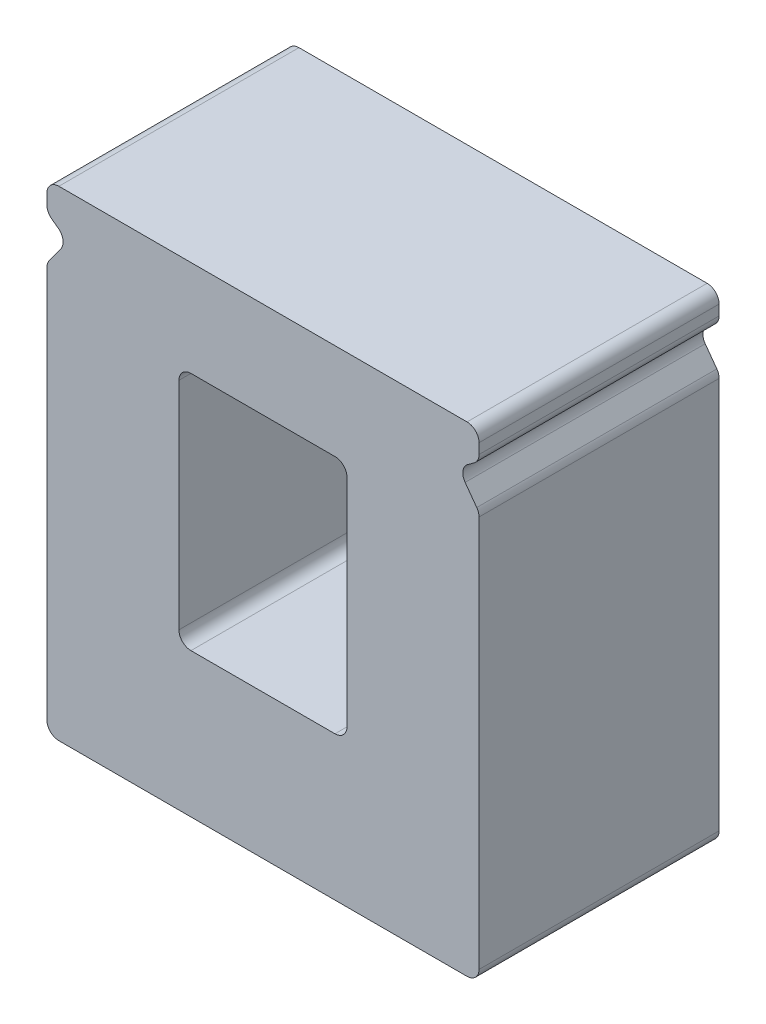
ISO-10303-21;
HEADER;
FILE_DESCRIPTION(('STEP AP214'),'2;1');
FILE_NAME('part.step','',(''),(''),'','','');
FILE_SCHEMA(('AUTOMOTIVE_DESIGN { 1 0 10303 214 1 1 1 1 }'));
ENDSEC;
DATA;
#1=APPLICATION_CONTEXT('core data for automotive mechanical design processes');
#2=APPLICATION_PROTOCOL_DEFINITION('international standard','automotive_design',2000,#1);
#3=PRODUCT_CONTEXT('',#1,'mechanical');
#4=PRODUCT('Part','Part','',(#3));
#5=PRODUCT_RELATED_PRODUCT_CATEGORY('part','',(#4));
#6=PRODUCT_DEFINITION_FORMATION('','',#4);
#7=PRODUCT_DEFINITION_CONTEXT('part definition',#1,'design');
#8=PRODUCT_DEFINITION('design','',#6,#7);
#9=PRODUCT_DEFINITION_SHAPE('','',#8);
#10=(LENGTH_UNIT() NAMED_UNIT(*) SI_UNIT(.MILLI.,.METRE.));
#11=(NAMED_UNIT(*) PLANE_ANGLE_UNIT() SI_UNIT($,.RADIAN.));
#12=(NAMED_UNIT(*) SI_UNIT($,.STERADIAN.) SOLID_ANGLE_UNIT());
#13=UNCERTAINTY_MEASURE_WITH_UNIT(LENGTH_MEASURE(1.E-05),#10,'distance_accuracy_value','');
#14=(GEOMETRIC_REPRESENTATION_CONTEXT(3) GLOBAL_UNCERTAINTY_ASSIGNED_CONTEXT((#13)) GLOBAL_UNIT_ASSIGNED_CONTEXT((#10,
#11,#12)) REPRESENTATION_CONTEXT('',''));
#15=CARTESIAN_POINT('',(0.,0.,0.));
#16=DIRECTION('',(0.,0.,1.));
#17=DIRECTION('',(1.,0.,0.));
#18=AXIS2_PLACEMENT_3D('',#15,#16,#17);
#19=CARTESIAN_POINT('',(-0.943975104065,-0.989782461654,0.));
#20=DIRECTION('',(0.,0.,1.));
#21=DIRECTION('',(1.,0.,0.));
#22=AXIS2_PLACEMENT_3D('',#19,#20,#21);
#23=PLANE('',#22);
#24=DIRECTION('',(1.,0.,0.));
#25=VECTOR('',#24,1.);
#26=CARTESIAN_POINT('',(0.856024895935,1.010217538346,0.));
#27=LINE('',#26,#25);
#28=CARTESIAN_POINT('',(-0.893975104065,1.010217538346,0.));
#29=VERTEX_POINT('',#28);
#30=CARTESIAN_POINT('',(0.806024895935,1.010217538346,0.));
#31=VERTEX_POINT('',#30);
#32=EDGE_CURVE('E268',#29,#31,#27,.T.);
#33=ORIENTED_EDGE('',*,*,#32,.T.);
#34=CARTESIAN_POINT('',(0.806024895935,0.960217538346,0.));
#35=DIRECTION('',(0.,0.,-1.));
#36=DIRECTION('',(-1.,0.,0.));
#37=AXIS2_PLACEMENT_3D('',#34,#35,#36);
#38=CIRCLE('',#37,0.05);
#39=CARTESIAN_POINT('',(0.856024895935,0.960217538346,0.));
#40=VERTEX_POINT('',#39);
#41=EDGE_CURVE('E272',#40,#31,#38,.F.);
#42=ORIENTED_EDGE('',*,*,#41,.F.);
#43=DIRECTION('',(0.,1.,0.));
#44=VECTOR('',#43,1.);
#45=CARTESIAN_POINT('',(0.856024895935,1.010217538346,0.));
#46=LINE('',#45,#44);
#47=CARTESIAN_POINT('',(0.856024895935,0.917544080107,0.));
#48=VERTEX_POINT('',#47);
#49=EDGE_CURVE('E275',#40,#48,#46,.F.);
#50=ORIENTED_EDGE('',*,*,#49,.T.);
#51=CARTESIAN_POINT('',(0.806024895935,0.917544080107,0.));
#52=DIRECTION('',(0.,0.,-1.));
#53=DIRECTION('',(-1.,0.,0.));
#54=AXIS2_PLACEMENT_3D('',#51,#52,#53);
#55=CIRCLE('',#54,0.05);
#56=CARTESIAN_POINT('',(0.835433480818422,0.877107275891953,0.));
#57=VERTEX_POINT('',#56);
#58=EDGE_CURVE('E305',#57,#48,#55,.F.);
#59=ORIENTED_EDGE('',*,*,#58,.F.);
#60=DIRECTION('',(0.808736084301861,0.588171697676871,0.));
#61=VECTOR('',#60,1.);
#62=CARTESIAN_POINT('',(0.809106947361,0.857960706105,0.));
#63=LINE('',#62,#61);
#64=CARTESIAN_POINT('',(0.809106947361182,0.857960706104903,0.));
#65=VERTEX_POINT('',#64);
#66=EDGE_CURVE('E303',#65,#57,#63,.T.);
#67=ORIENTED_EDGE('',*,*,#66,.F.);
#68=CARTESIAN_POINT('',(0.838515532245,0.81752390189,0.));
#69=DIRECTION('',(0.,0.,1.));
#70=DIRECTION('',(1.,0.,0.));
#71=AXIS2_PLACEMENT_3D('',#68,#69,#70);
#72=CIRCLE('',#71,0.05);
#73=CARTESIAN_POINT('',(0.79807872802992,0.788115317006124,0.));
#74=VERTEX_POINT('',#73);
#75=EDGE_CURVE('E306',#74,#65,#72,.F.);
#76=ORIENTED_EDGE('',*,*,#75,.F.);
#77=DIRECTION('',(-0.588171697675045,0.808736084303189,0.));
#78=VECTOR('',#77,1.);
#79=CARTESIAN_POINT('',(0.84646170015,0.721588730341,0.));
#80=LINE('',#79,#78);
#81=CARTESIAN_POINT('',(0.846461700149734,0.721588730341124,0.));
#82=VERTEX_POINT('',#81);
#83=EDGE_CURVE('E204',#82,#74,#80,.T.);
#84=ORIENTED_EDGE('',*,*,#83,.F.);
#85=CARTESIAN_POINT('',(0.806024895935,0.692180145458,0.));
#86=DIRECTION('',(0.,0.,-1.));
#87=DIRECTION('',(-1.,0.,0.));
#88=AXIS2_PLACEMENT_3D('',#85,#86,#87);
#89=CIRCLE('',#88,0.05);
#90=CARTESIAN_POINT('',(0.856024895935,0.692180145458,0.));
#91=VERTEX_POINT('',#90);
#92=EDGE_CURVE('E20',#91,#82,#89,.F.);
#93=ORIENTED_EDGE('',*,*,#92,.F.);
#94=DIRECTION('',(0.,-1.,0.));
#95=VECTOR('',#94,1.);
#96=CARTESIAN_POINT('',(0.856024895935,0.708439336137,0.));
#97=LINE('',#96,#95);
#98=CARTESIAN_POINT('',(0.856024895935,-0.939782461654,0.));
#99=VERTEX_POINT('',#98);
#100=EDGE_CURVE('E201',#91,#99,#97,.T.);
#101=ORIENTED_EDGE('',*,*,#100,.T.);
#102=CARTESIAN_POINT('',(0.806024895935,-0.939782461654,0.));
#103=DIRECTION('',(0.,0.,-1.));
#104=DIRECTION('',(-1.,0.,0.));
#105=AXIS2_PLACEMENT_3D('',#102,#103,#104);
#106=CIRCLE('',#105,0.05);
#107=CARTESIAN_POINT('',(0.806024895935,-0.989782461654,0.));
#108=VERTEX_POINT('',#107);
#109=EDGE_CURVE('E230',#108,#99,#106,.F.);
#110=ORIENTED_EDGE('',*,*,#109,.F.);
#111=DIRECTION('',(1.,0.,0.));
#112=VECTOR('',#111,1.);
#113=CARTESIAN_POINT('',(-0.943975104065,-0.989782461654,0.));
#114=LINE('',#113,#112);
#115=CARTESIAN_POINT('',(-0.893975104065,-0.989782461654,0.));
#116=VERTEX_POINT('',#115);
#117=EDGE_CURVE('E233',#108,#116,#114,.F.);
#118=ORIENTED_EDGE('',*,*,#117,.T.);
#119=CARTESIAN_POINT('',(-0.893975104065,-0.939782461654,0.));
#120=DIRECTION('',(0.,0.,-1.));
#121=DIRECTION('',(-1.,0.,0.));
#122=AXIS2_PLACEMENT_3D('',#119,#120,#121);
#123=CIRCLE('',#122,0.05);
#124=CARTESIAN_POINT('',(-0.943975104065,-0.939782461654,0.));
#125=VERTEX_POINT('',#124);
#126=EDGE_CURVE('E237',#125,#116,#123,.F.);
#127=ORIENTED_EDGE('',*,*,#126,.F.);
#128=DIRECTION('',(0.,1.,0.));
#129=VECTOR('',#128,1.);
#130=CARTESIAN_POINT('',(-0.943975104065,0.708439336137,0.));
#131=LINE('',#130,#129);
#132=CARTESIAN_POINT('',(-0.943975104065,0.692180145458,0.));
#133=VERTEX_POINT('',#132);
#134=EDGE_CURVE('E240',#125,#133,#131,.T.);
#135=ORIENTED_EDGE('',*,*,#134,.T.);
#136=CARTESIAN_POINT('',(-0.893975104065,0.692180145458,0.));
#137=DIRECTION('',(0.,0.,-1.));
#138=DIRECTION('',(-1.,0.,0.));
#139=AXIS2_PLACEMENT_3D('',#136,#137,#138);
#140=CIRCLE('',#139,0.05);
#141=CARTESIAN_POINT('',(-0.934411908280464,0.721588730341294,0.));
#142=VERTEX_POINT('',#141);
#143=EDGE_CURVE('E244',#142,#133,#140,.F.);
#144=ORIENTED_EDGE('',*,*,#143,.F.);
#145=DIRECTION('',(0.588171697675106,0.808736084303145,0.));
#146=VECTOR('',#145,1.);
#147=CARTESIAN_POINT('',(-0.856620351277,0.828552121221,0.));
#148=LINE('',#147,#146);
#149=CARTESIAN_POINT('',(-0.88602893616068,0.788115317005947,0.));
#150=VERTEX_POINT('',#149);
#151=EDGE_CURVE('E248',#142,#150,#148,.T.);
#152=ORIENTED_EDGE('',*,*,#151,.T.);
#153=CARTESIAN_POINT('',(-0.926465740376,0.81752390189,0.));
#154=DIRECTION('',(0.,0.,1.));
#155=DIRECTION('',(1.,0.,0.));
#156=AXIS2_PLACEMENT_3D('',#153,#154,#155);
#157=CIRCLE('',#156,0.05);
#158=CARTESIAN_POINT('',(-0.897057155492059,0.857960706105166,0.));
#159=VERTEX_POINT('',#158);
#160=EDGE_CURVE('E251',#150,#159,#157,.T.);
#161=ORIENTED_EDGE('',*,*,#160,.T.);
#162=DIRECTION('',(-0.808736084303145,0.588171697675106,0.));
#163=VECTOR('',#162,1.);
#164=CARTESIAN_POINT('',(-0.943975104065,0.892082850522,0.));
#165=LINE('',#164,#163);
#166=CARTESIAN_POINT('',(-0.923383688948797,0.877107275892032,0.));
#167=VERTEX_POINT('',#166);
#168=EDGE_CURVE('E254',#159,#167,#165,.T.);
#169=ORIENTED_EDGE('',*,*,#168,.T.);
#170=CARTESIAN_POINT('',(-0.893975104065,0.917544080107,0.));
#171=DIRECTION('',(0.,0.,-1.));
#172=DIRECTION('',(-1.,0.,0.));
#173=AXIS2_PLACEMENT_3D('',#170,#171,#172);
#174=CIRCLE('',#173,0.05);
#175=CARTESIAN_POINT('',(-0.943975104065,0.917544080107,0.));
#176=VERTEX_POINT('',#175);
#177=EDGE_CURVE('E258',#176,#167,#174,.F.);
#178=ORIENTED_EDGE('',*,*,#177,.F.);
#179=DIRECTION('',(0.,1.,0.));
#180=VECTOR('',#179,1.);
#181=CARTESIAN_POINT('',(-0.943975104065,1.010217538346,0.));
#182=LINE('',#181,#180);
#183=CARTESIAN_POINT('',(-0.943975104065,0.960217538346,0.));
#184=VERTEX_POINT('',#183);
#185=EDGE_CURVE('E261',#176,#184,#182,.T.);
#186=ORIENTED_EDGE('',*,*,#185,.T.);
#187=CARTESIAN_POINT('',(-0.893975104065,0.960217538346,0.));
#188=DIRECTION('',(0.,0.,-1.));
#189=DIRECTION('',(-1.,0.,0.));
#190=AXIS2_PLACEMENT_3D('',#187,#188,#189);
#191=CIRCLE('',#190,0.05);
#192=EDGE_CURVE('E265',#29,#184,#191,.F.);
#193=ORIENTED_EDGE('',*,*,#192,.F.);
#194=EDGE_LOOP('',(#33,#42,#50,#59,#67,#76,#84,#93,#101,#110,#118,#127,#135,#144,#152,#161,#169,
#178,#186,#193));
#195=FACE_BOUND('',#194,.T.);
#196=DIRECTION('',(0.,1.,0.));
#197=VECTOR('',#196,1.);
#198=CARTESIAN_POINT('',(-0.393975104065,0.610217538346,0.));
#199=LINE('',#198,#197);
#200=CARTESIAN_POINT('',(-0.393975104065,-0.339782461654,0.));
#201=VERTEX_POINT('',#200);
#202=CARTESIAN_POINT('',(-0.393975104065,0.560217538346,0.));
#203=VERTEX_POINT('',#202);
#204=EDGE_CURVE('E290',#201,#203,#199,.T.);
#205=ORIENTED_EDGE('',*,*,#204,.F.);
#206=CARTESIAN_POINT('',(-0.343975104065,-0.339782461654,0.));
#207=DIRECTION('',(0.,0.,1.));
#208=DIRECTION('',(1.,0.,0.));
#209=AXIS2_PLACEMENT_3D('',#206,#207,#208);
#210=CIRCLE('',#209,0.05);
#211=CARTESIAN_POINT('',(-0.343975104065,-0.389782461654,0.));
#212=VERTEX_POINT('',#211);
#213=EDGE_CURVE('E293',#201,#212,#210,.T.);
#214=ORIENTED_EDGE('',*,*,#213,.T.);
#215=DIRECTION('',(1.,0.,0.));
#216=VECTOR('',#215,1.);
#217=CARTESIAN_POINT('',(-0.393975104065,-0.389782461654,0.));
#218=LINE('',#217,#216);
#219=CARTESIAN_POINT('',(0.256024895935,-0.389782461654,0.));
#220=VERTEX_POINT('',#219);
#221=EDGE_CURVE('E297',#220,#212,#218,.F.);
#222=ORIENTED_EDGE('',*,*,#221,.F.);
#223=CARTESIAN_POINT('',(0.256024895935,-0.339782461654,0.));
#224=DIRECTION('',(0.,0.,1.));
#225=DIRECTION('',(1.,0.,0.));
#226=AXIS2_PLACEMENT_3D('',#223,#224,#225);
#227=CIRCLE('',#226,0.05);
#228=CARTESIAN_POINT('',(0.306024895935,-0.339782461654,0.));
#229=VERTEX_POINT('',#228);
#230=EDGE_CURVE('E300',#220,#229,#227,.T.);
#231=ORIENTED_EDGE('',*,*,#230,.T.);
#232=DIRECTION('',(0.,-1.,0.));
#233=VECTOR('',#232,1.);
#234=CARTESIAN_POINT('',(0.306024895935,0.610217538346,0.));
#235=LINE('',#234,#233);
#236=CARTESIAN_POINT('',(0.306024895935,0.560217538346,0.));
#237=VERTEX_POINT('',#236);
#238=EDGE_CURVE('E316',#237,#229,#235,.T.);
#239=ORIENTED_EDGE('',*,*,#238,.F.);
#240=CARTESIAN_POINT('',(0.256024895935,0.560217538346,0.));
#241=DIRECTION('',(0.,0.,1.));
#242=DIRECTION('',(1.,0.,0.));
#243=AXIS2_PLACEMENT_3D('',#240,#241,#242);
#244=CIRCLE('',#243,0.05);
#245=CARTESIAN_POINT('',(0.256024895935,0.610217538346,0.));
#246=VERTEX_POINT('',#245);
#247=EDGE_CURVE('E276',#237,#246,#244,.T.);
#248=ORIENTED_EDGE('',*,*,#247,.T.);
#249=DIRECTION('',(1.,0.,0.));
#250=VECTOR('',#249,1.);
#251=CARTESIAN_POINT('',(0.306024895935,0.610217538346,0.));
#252=LINE('',#251,#250);
#253=CARTESIAN_POINT('',(-0.343975104065,0.610217538346,0.));
#254=VERTEX_POINT('',#253);
#255=EDGE_CURVE('E283',#254,#246,#252,.T.);
#256=ORIENTED_EDGE('',*,*,#255,.F.);
#257=CARTESIAN_POINT('',(-0.343975104065,0.560217538346,0.));
#258=DIRECTION('',(0.,0.,1.));
#259=DIRECTION('',(1.,0.,0.));
#260=AXIS2_PLACEMENT_3D('',#257,#258,#259);
#261=CIRCLE('',#260,0.05);
#262=EDGE_CURVE('E286',#254,#203,#261,.T.);
#263=ORIENTED_EDGE('',*,*,#262,.T.);
#264=EDGE_LOOP('',(#205,#214,#222,#231,#239,#248,#256,#263));
#265=FACE_BOUND('',#264,.T.);
#266=ADVANCED_FACE('F17',(#195,#265),#23,.F.);
#267=CARTESIAN_POINT('',(0.306024895935,0.610217538346,1.));
#268=DIRECTION('',(-1.,0.,0.));
#269=DIRECTION('',(0.,-1.,0.));
#270=AXIS2_PLACEMENT_3D('',#267,#268,#269);
#271=PLANE('',#270);
#272=ORIENTED_EDGE('',*,*,#238,.T.);
#273=DIRECTION('',(0.,0.,1.));
#274=VECTOR('',#273,1.);
#275=CARTESIAN_POINT('',(0.306024895935,-0.339782461654,1.));
#276=LINE('',#275,#274);
#277=CARTESIAN_POINT('',(0.306024895935,-0.339782461654,1.));
#278=VERTEX_POINT('',#277);
#279=EDGE_CURVE('E298',#229,#278,#276,.T.);
#280=ORIENTED_EDGE('',*,*,#279,.T.);
#281=DIRECTION('',(0.,1.,0.));
#282=VECTOR('',#281,1.);
#283=CARTESIAN_POINT('',(0.306024895935,-0.989782461654,1.));
#284=LINE('',#283,#282);
#285=CARTESIAN_POINT('',(0.306024895935,0.560217538346,1.));
#286=VERTEX_POINT('',#285);
#287=EDGE_CURVE('E371',#286,#278,#284,.F.);
#288=ORIENTED_EDGE('',*,*,#287,.F.);
#289=DIRECTION('',(0.,0.,1.));
#290=VECTOR('',#289,1.);
#291=CARTESIAN_POINT('',(0.306024895935,0.560217538346,1.));
#292=LINE('',#291,#290);
#293=EDGE_CURVE('E277',#286,#237,#292,.F.);
#294=ORIENTED_EDGE('',*,*,#293,.T.);
#295=EDGE_LOOP('',(#272,#280,#288,#294));
#296=FACE_BOUND('',#295,.T.);
#297=ADVANCED_FACE('F466',(#296),#271,.T.);
#298=CARTESIAN_POINT('',(0.256024895935,-0.339782461654,1.));
#299=DIRECTION('',(0.,0.,1.));
#300=DIRECTION('',(1.,0.,0.));
#301=AXIS2_PLACEMENT_3D('',#298,#299,#300);
#302=CYLINDRICAL_SURFACE('',#301,0.05);
#303=ORIENTED_EDGE('',*,*,#230,.F.);
#304=DIRECTION('',(0.,0.,1.));
#305=VECTOR('',#304,1.);
#306=CARTESIAN_POINT('',(0.256024895935,-0.389782461654,1.));
#307=LINE('',#306,#305);
#308=CARTESIAN_POINT('',(0.256024895935,-0.389782461654,1.));
#309=VERTEX_POINT('',#308);
#310=EDGE_CURVE('E294',#309,#220,#307,.F.);
#311=ORIENTED_EDGE('',*,*,#310,.F.);
#312=CARTESIAN_POINT('',(0.256024895935,-0.339782461654,1.));
#313=DIRECTION('',(0.,0.,1.));
#314=DIRECTION('',(1.,0.,0.));
#315=AXIS2_PLACEMENT_3D('',#312,#313,#314);
#316=CIRCLE('',#315,0.05);
#317=EDGE_CURVE('E368',#278,#309,#316,.F.);
#318=ORIENTED_EDGE('',*,*,#317,.F.);
#319=ORIENTED_EDGE('',*,*,#279,.F.);
#320=EDGE_LOOP('',(#303,#311,#318,#319));
#321=FACE_BOUND('',#320,.T.);
#322=ADVANCED_FACE('F470',(#321),#302,.F.);
#323=CARTESIAN_POINT('',(-0.393975104065,-0.389782461654,1.));
#324=DIRECTION('',(0.,1.,0.));
#325=DIRECTION('',(0.,0.,1.));
#326=AXIS2_PLACEMENT_3D('',#323,#324,#325);
#327=PLANE('',#326);
#328=DIRECTION('',(1.,0.,0.));
#329=VECTOR('',#328,1.);
#330=CARTESIAN_POINT('',(-0.943975104065,-0.389782461654,1.));
#331=LINE('',#330,#329);
#332=CARTESIAN_POINT('',(-0.343975104065,-0.389782461654,1.));
#333=VERTEX_POINT('',#332);
#334=EDGE_CURVE('E367',#309,#333,#331,.F.);
#335=ORIENTED_EDGE('',*,*,#334,.F.);
#336=ORIENTED_EDGE('',*,*,#310,.T.);
#337=ORIENTED_EDGE('',*,*,#221,.T.);
#338=DIRECTION('',(0.,0.,1.));
#339=VECTOR('',#338,1.);
#340=CARTESIAN_POINT('',(-0.343975104065,-0.389782461654,1.));
#341=LINE('',#340,#339);
#342=EDGE_CURVE('E291',#212,#333,#341,.T.);
#343=ORIENTED_EDGE('',*,*,#342,.T.);
#344=EDGE_LOOP('',(#335,#336,#337,#343));
#345=FACE_BOUND('',#344,.T.);
#346=ADVANCED_FACE('F443',(#345),#327,.T.);
#347=CARTESIAN_POINT('',(-0.343975104065,-0.339782461654,1.));
#348=DIRECTION('',(0.,0.,1.));
#349=DIRECTION('',(1.,0.,0.));
#350=AXIS2_PLACEMENT_3D('',#347,#348,#349);
#351=CYLINDRICAL_SURFACE('',#350,0.05);
#352=ORIENTED_EDGE('',*,*,#213,.F.);
#353=DIRECTION('',(0.,0.,1.));
#354=VECTOR('',#353,1.);
#355=CARTESIAN_POINT('',(-0.393975104065,-0.339782461654,1.));
#356=LINE('',#355,#354);
#357=CARTESIAN_POINT('',(-0.393975104065,-0.339782461654,1.));
#358=VERTEX_POINT('',#357);
#359=EDGE_CURVE('E287',#358,#201,#356,.F.);
#360=ORIENTED_EDGE('',*,*,#359,.F.);
#361=CARTESIAN_POINT('',(-0.343975104065,-0.339782461654,1.));
#362=DIRECTION('',(0.,0.,1.));
#363=DIRECTION('',(1.,0.,0.));
#364=AXIS2_PLACEMENT_3D('',#361,#362,#363);
#365=CIRCLE('',#364,0.05);
#366=EDGE_CURVE('E364',#333,#358,#365,.F.);
#367=ORIENTED_EDGE('',*,*,#366,.F.);
#368=ORIENTED_EDGE('',*,*,#342,.F.);
#369=EDGE_LOOP('',(#352,#360,#367,#368));
#370=FACE_BOUND('',#369,.T.);
#371=ADVANCED_FACE('F447',(#370),#351,.F.);
#372=CARTESIAN_POINT('',(-0.393975104065,0.610217538346,1.));
#373=DIRECTION('',(1.,0.,0.));
#374=DIRECTION('',(0.,1.,0.));
#375=AXIS2_PLACEMENT_3D('',#372,#373,#374);
#376=PLANE('',#375);
#377=DIRECTION('',(0.,1.,0.));
#378=VECTOR('',#377,1.);
#379=CARTESIAN_POINT('',(-0.393975104065,-0.989782461654,1.));
#380=LINE('',#379,#378);
#381=CARTESIAN_POINT('',(-0.393975104065,0.560217538346,1.));
#382=VERTEX_POINT('',#381);
#383=EDGE_CURVE('E363',#358,#382,#380,.T.);
#384=ORIENTED_EDGE('',*,*,#383,.F.);
#385=ORIENTED_EDGE('',*,*,#359,.T.);
#386=ORIENTED_EDGE('',*,*,#204,.T.);
#387=DIRECTION('',(0.,0.,1.));
#388=VECTOR('',#387,1.);
#389=CARTESIAN_POINT('',(-0.393975104065,0.560217538346,1.));
#390=LINE('',#389,#388);
#391=EDGE_CURVE('E284',#203,#382,#390,.T.);
#392=ORIENTED_EDGE('',*,*,#391,.T.);
#393=EDGE_LOOP('',(#384,#385,#386,#392));
#394=FACE_BOUND('',#393,.T.);
#395=ADVANCED_FACE('F450',(#394),#376,.T.);
#396=CARTESIAN_POINT('',(-0.343975104065,0.560217538346,1.));
#397=DIRECTION('',(0.,0.,1.));
#398=DIRECTION('',(1.,0.,0.));
#399=AXIS2_PLACEMENT_3D('',#396,#397,#398);
#400=CYLINDRICAL_SURFACE('',#399,0.05);
#401=ORIENTED_EDGE('',*,*,#262,.F.);
#402=DIRECTION('',(0.,0.,-1.));
#403=VECTOR('',#402,1.);
#404=CARTESIAN_POINT('',(-0.343975104065,0.610217538346,1.));
#405=LINE('',#404,#403);
#406=CARTESIAN_POINT('',(-0.343975104065,0.610217538346,1.));
#407=VERTEX_POINT('',#406);
#408=EDGE_CURVE('E280',#407,#254,#405,.T.);
#409=ORIENTED_EDGE('',*,*,#408,.F.);
#410=CARTESIAN_POINT('',(-0.343975104065,0.560217538346,1.));
#411=DIRECTION('',(0.,0.,1.));
#412=DIRECTION('',(1.,0.,0.));
#413=AXIS2_PLACEMENT_3D('',#410,#411,#412);
#414=CIRCLE('',#413,0.05);
#415=EDGE_CURVE('E360',#382,#407,#414,.F.);
#416=ORIENTED_EDGE('',*,*,#415,.F.);
#417=ORIENTED_EDGE('',*,*,#391,.F.);
#418=EDGE_LOOP('',(#401,#409,#416,#417));
#419=FACE_BOUND('',#418,.T.);
#420=ADVANCED_FACE('F456',(#419),#400,.F.);
#421=CARTESIAN_POINT('',(0.306024895935,0.610217538346,1.));
#422=DIRECTION('',(0.,-1.,0.));
#423=DIRECTION('',(0.,0.,-1.));
#424=AXIS2_PLACEMENT_3D('',#421,#422,#423);
#425=PLANE('',#424);
#426=DIRECTION('',(1.,0.,0.));
#427=VECTOR('',#426,1.);
#428=CARTESIAN_POINT('',(-0.943975104065,0.610217538346,1.));
#429=LINE('',#428,#427);
#430=CARTESIAN_POINT('',(0.256024895935,0.610217538346,1.));
#431=VERTEX_POINT('',#430);
#432=EDGE_CURVE('E359',#407,#431,#429,.T.);
#433=ORIENTED_EDGE('',*,*,#432,.F.);
#434=ORIENTED_EDGE('',*,*,#408,.T.);
#435=ORIENTED_EDGE('',*,*,#255,.T.);
#436=DIRECTION('',(0.,0.,1.));
#437=VECTOR('',#436,1.);
#438=CARTESIAN_POINT('',(0.256024895935,0.610217538346,1.));
#439=LINE('',#438,#437);
#440=EDGE_CURVE('E273',#246,#431,#439,.T.);
#441=ORIENTED_EDGE('',*,*,#440,.T.);
#442=EDGE_LOOP('',(#433,#434,#435,#441));
#443=FACE_BOUND('',#442,.T.);
#444=ADVANCED_FACE('F458',(#443),#425,.T.);
#445=CARTESIAN_POINT('',(0.256024895935,0.560217538346,1.));
#446=DIRECTION('',(0.,0.,1.));
#447=DIRECTION('',(1.,0.,0.));
#448=AXIS2_PLACEMENT_3D('',#445,#446,#447);
#449=CYLINDRICAL_SURFACE('',#448,0.05);
#450=ORIENTED_EDGE('',*,*,#247,.F.);
#451=ORIENTED_EDGE('',*,*,#293,.F.);
#452=CARTESIAN_POINT('',(0.256024895935,0.560217538346,1.));
#453=DIRECTION('',(0.,0.,1.));
#454=DIRECTION('',(1.,0.,0.));
#455=AXIS2_PLACEMENT_3D('',#452,#453,#454);
#456=CIRCLE('',#455,0.05);
#457=EDGE_CURVE('E356',#431,#286,#456,.F.);
#458=ORIENTED_EDGE('',*,*,#457,.F.);
#459=ORIENTED_EDGE('',*,*,#440,.F.);
#460=EDGE_LOOP('',(#450,#451,#458,#459));
#461=FACE_BOUND('',#460,.T.);
#462=ADVANCED_FACE('F464',(#461),#449,.F.);
#463=CARTESIAN_POINT('',(0.856024895935,1.010217538346,1.));
#464=DIRECTION('',(-1.,0.,0.));
#465=DIRECTION('',(0.,0.,1.));
#466=AXIS2_PLACEMENT_3D('',#463,#464,#465);
#467=PLANE('',#466);
#468=ORIENTED_EDGE('',*,*,#49,.F.);
#469=DIRECTION('',(0.,0.,-1.));
#470=VECTOR('',#469,1.);
#471=CARTESIAN_POINT('',(0.856024895935,0.960217538346,1.));
#472=LINE('',#471,#470);
#473=CARTESIAN_POINT('',(0.856024895935,0.960217538346,1.));
#474=VERTEX_POINT('',#473);
#475=EDGE_CURVE('E269',#474,#40,#472,.T.);
#476=ORIENTED_EDGE('',*,*,#475,.F.);
#477=DIRECTION('',(0.,1.,0.));
#478=VECTOR('',#477,1.);
#479=CARTESIAN_POINT('',(0.856024895935,-0.989782461654,1.));
#480=LINE('',#479,#478);
#481=CARTESIAN_POINT('',(0.856024895935,0.917544080107,1.));
#482=VERTEX_POINT('',#481);
#483=EDGE_CURVE('E355',#482,#474,#480,.T.);
#484=ORIENTED_EDGE('',*,*,#483,.F.);
#485=DIRECTION('',(0.,0.,-1.));
#486=VECTOR('',#485,1.);
#487=CARTESIAN_POINT('',(0.856024895935,0.917544080107,1.));
#488=LINE('',#487,#486);
#489=EDGE_CURVE('E397',#48,#482,#488,.F.);
#490=ORIENTED_EDGE('',*,*,#489,.F.);
#491=EDGE_LOOP('',(#468,#476,#484,#490));
#492=FACE_BOUND('',#491,.T.);
#493=ADVANCED_FACE('F544',(#492),#467,.F.);
#494=CARTESIAN_POINT('',(0.806024895935,0.960217538346,1.));
#495=DIRECTION('',(0.,0.,-1.));
#496=DIRECTION('',(-1.,0.,0.));
#497=AXIS2_PLACEMENT_3D('',#494,#495,#496);
#498=CYLINDRICAL_SURFACE('',#497,0.05);
#499=CARTESIAN_POINT('',(0.806024895935,0.960217538346,1.));
#500=DIRECTION('',(0.,0.,-1.));
#501=DIRECTION('',(-1.,0.,0.));
#502=AXIS2_PLACEMENT_3D('',#499,#500,#501);
#503=CIRCLE('',#502,0.05);
#504=CARTESIAN_POINT('',(0.806024895935,1.010217538346,1.));
#505=VERTEX_POINT('',#504);
#506=EDGE_CURVE('E352',#474,#505,#503,.F.);
#507=ORIENTED_EDGE('',*,*,#506,.F.);
#508=ORIENTED_EDGE('',*,*,#475,.T.);
#509=ORIENTED_EDGE('',*,*,#41,.T.);
#510=DIRECTION('',(0.,0.,-1.));
#511=VECTOR('',#510,1.);
#512=CARTESIAN_POINT('',(0.806024895935,1.010217538346,1.));
#513=LINE('',#512,#511);
#514=EDGE_CURVE('E266',#31,#505,#513,.F.);
#515=ORIENTED_EDGE('',*,*,#514,.T.);
#516=EDGE_LOOP('',(#507,#508,#509,#515));
#517=FACE_BOUND('',#516,.T.);
#518=ADVANCED_FACE('F540',(#517),#498,.T.);
#519=CARTESIAN_POINT('',(0.856024895935,1.010217538346,1.));
#520=DIRECTION('',(0.,-1.,0.));
#521=DIRECTION('',(0.,0.,-1.));
#522=AXIS2_PLACEMENT_3D('',#519,#520,#521);
#523=PLANE('',#522);
#524=DIRECTION('',(1.,0.,0.));
#525=VECTOR('',#524,1.);
#526=CARTESIAN_POINT('',(-0.943975104065,1.010217538346,1.));
#527=LINE('',#526,#525);
#528=CARTESIAN_POINT('',(-0.893975104065,1.010217538346,1.));
#529=VERTEX_POINT('',#528);
#530=EDGE_CURVE('E351',#505,#529,#527,.F.);
#531=ORIENTED_EDGE('',*,*,#530,.F.);
#532=ORIENTED_EDGE('',*,*,#514,.F.);
#533=ORIENTED_EDGE('',*,*,#32,.F.);
#534=DIRECTION('',(0.,0.,-1.));
#535=VECTOR('',#534,1.);
#536=CARTESIAN_POINT('',(-0.893975104065,1.010217538346,1.));
#537=LINE('',#536,#535);
#538=EDGE_CURVE('E262',#529,#29,#537,.T.);
#539=ORIENTED_EDGE('',*,*,#538,.F.);
#540=EDGE_LOOP('',(#531,#532,#533,#539));
#541=FACE_BOUND('',#540,.T.);
#542=ADVANCED_FACE('F536',(#541),#523,.F.);
#543=CARTESIAN_POINT('',(-0.893975104065,0.960217538346,1.));
#544=DIRECTION('',(0.,0.,-1.));
#545=DIRECTION('',(-1.,0.,0.));
#546=AXIS2_PLACEMENT_3D('',#543,#544,#545);
#547=CYLINDRICAL_SURFACE('',#546,0.05);
#548=CARTESIAN_POINT('',(-0.893975104065,0.960217538346,1.));
#549=DIRECTION('',(0.,0.,-1.));
#550=DIRECTION('',(-1.,0.,0.));
#551=AXIS2_PLACEMENT_3D('',#548,#549,#550);
#552=CIRCLE('',#551,0.05);
#553=CARTESIAN_POINT('',(-0.943975104065,0.960217538346,1.));
#554=VERTEX_POINT('',#553);
#555=EDGE_CURVE('E348',#529,#554,#552,.F.);
#556=ORIENTED_EDGE('',*,*,#555,.F.);
#557=ORIENTED_EDGE('',*,*,#538,.T.);
#558=ORIENTED_EDGE('',*,*,#192,.T.);
#559=DIRECTION('',(0.,0.,-1.));
#560=VECTOR('',#559,1.);
#561=CARTESIAN_POINT('',(-0.943975104065,0.960217538346,1.));
#562=LINE('',#561,#560);
#563=EDGE_CURVE('E259',#184,#554,#562,.F.);
#564=ORIENTED_EDGE('',*,*,#563,.T.);
#565=EDGE_LOOP('',(#556,#557,#558,#564));
#566=FACE_BOUND('',#565,.T.);
#567=ADVANCED_FACE('F532',(#566),#547,.T.);
#568=CARTESIAN_POINT('',(-0.943975104065,1.010217538346,1.));
#569=DIRECTION('',(1.,0.,0.));
#570=DIRECTION('',(0.,0.,-1.));
#571=AXIS2_PLACEMENT_3D('',#568,#569,#570);
#572=PLANE('',#571);
#573=ORIENTED_EDGE('',*,*,#185,.F.);
#574=DIRECTION('',(0.,0.,-1.));
#575=VECTOR('',#574,1.);
#576=CARTESIAN_POINT('',(-0.943975104065,0.917544080107,1.));
#577=LINE('',#576,#575);
#578=CARTESIAN_POINT('',(-0.943975104065,0.917544080107,1.));
#579=VERTEX_POINT('',#578);
#580=EDGE_CURVE('E255',#579,#176,#577,.T.);
#581=ORIENTED_EDGE('',*,*,#580,.F.);
#582=DIRECTION('',(0.,1.,0.));
#583=VECTOR('',#582,1.);
#584=CARTESIAN_POINT('',(-0.943975104065,-0.989782461654,1.));
#585=LINE('',#584,#583);
#586=EDGE_CURVE('E347',#554,#579,#585,.F.);
#587=ORIENTED_EDGE('',*,*,#586,.F.);
#588=ORIENTED_EDGE('',*,*,#563,.F.);
#589=EDGE_LOOP('',(#573,#581,#587,#588));
#590=FACE_BOUND('',#589,.T.);
#591=ADVANCED_FACE('F528',(#590),#572,.F.);
#592=CARTESIAN_POINT('',(-0.893975104065,0.917544080107,1.));
#593=DIRECTION('',(0.,0.,-1.));
#594=DIRECTION('',(-1.,0.,0.));
#595=AXIS2_PLACEMENT_3D('',#592,#593,#594);
#596=CYLINDRICAL_SURFACE('',#595,0.05);
#597=CARTESIAN_POINT('',(-0.893975104065,0.917544080107,1.));
#598=DIRECTION('',(0.,0.,-1.));
#599=DIRECTION('',(-1.,0.,0.));
#600=AXIS2_PLACEMENT_3D('',#597,#598,#599);
#601=CIRCLE('',#600,0.05);
#602=CARTESIAN_POINT('',(-0.923383688948884,0.877107275892005,1.));
#603=VERTEX_POINT('',#602);
#604=EDGE_CURVE('E344',#579,#603,#601,.F.);
#605=ORIENTED_EDGE('',*,*,#604,.F.);
#606=ORIENTED_EDGE('',*,*,#580,.T.);
#607=ORIENTED_EDGE('',*,*,#177,.T.);
#608=DIRECTION('',(0.,0.,1.));
#609=VECTOR('',#608,1.);
#610=CARTESIAN_POINT('',(-0.923383688948915,0.877107275892117,1.));
#611=LINE('',#610,#609);
#612=EDGE_CURVE('E252',#167,#603,#611,.T.);
#613=ORIENTED_EDGE('',*,*,#612,.T.);
#614=EDGE_LOOP('',(#605,#606,#607,#613));
#615=FACE_BOUND('',#614,.T.);
#616=ADVANCED_FACE('F524',(#615),#596,.T.);
#617=CARTESIAN_POINT('',(-0.943975104065,0.892082850522,1.));
#618=DIRECTION('',(0.588171697675106,0.808736084303145,0.));
#619=DIRECTION('',(-0.808736084303145,0.588171697675106,0.));
#620=AXIS2_PLACEMENT_3D('',#617,#618,#619);
#621=PLANE('',#620);
#622=ORIENTED_EDGE('',*,*,#168,.F.);
#623=DIRECTION('',(0.,0.,1.));
#624=VECTOR('',#623,1.);
#625=CARTESIAN_POINT('',(-0.89705715549201,0.857960706104987,1.));
#626=LINE('',#625,#624);
#627=CARTESIAN_POINT('',(-0.897057155492078,0.857960706105047,1.));
#628=VERTEX_POINT('',#627);
#629=EDGE_CURVE('E249',#159,#628,#626,.T.);
#630=ORIENTED_EDGE('',*,*,#629,.T.);
#631=DIRECTION('',(0.80873608430186,-0.588171697676873,0.));
#632=VECTOR('',#631,1.);
#633=CARTESIAN_POINT('',(-0.923383688949,0.877107275892,1.));
#634=LINE('',#633,#632);
#635=EDGE_CURVE('E343',#603,#628,#634,.T.);
#636=ORIENTED_EDGE('',*,*,#635,.F.);
#637=ORIENTED_EDGE('',*,*,#612,.F.);
#638=EDGE_LOOP('',(#622,#630,#636,#637));
#639=FACE_BOUND('',#638,.T.);
#640=ADVANCED_FACE('F520',(#639),#621,.F.);
#641=CARTESIAN_POINT('',(-0.926465740376,0.81752390189,1.));
#642=DIRECTION('',(0.,0.,1.));
#643=DIRECTION('',(1.,0.,0.));
#644=AXIS2_PLACEMENT_3D('',#641,#642,#643);
#645=CYLINDRICAL_SURFACE('',#644,0.05);
#646=ORIENTED_EDGE('',*,*,#160,.F.);
#647=DIRECTION('',(0.,0.,1.));
#648=VECTOR('',#647,1.);
#649=CARTESIAN_POINT('',(-0.886028936160765,0.788115317005829,1.));
#650=LINE('',#649,#648);
#651=CARTESIAN_POINT('',(-0.886028936160796,0.788115317006034,1.));
#652=VERTEX_POINT('',#651);
#653=EDGE_CURVE('E245',#150,#652,#650,.T.);
#654=ORIENTED_EDGE('',*,*,#653,.T.);
#655=CARTESIAN_POINT('',(-0.926465740376,0.81752390189,1.));
#656=DIRECTION('',(0.,0.,1.));
#657=DIRECTION('',(1.,0.,0.));
#658=AXIS2_PLACEMENT_3D('',#655,#656,#657);
#659=CIRCLE('',#658,0.05);
#660=EDGE_CURVE('E341',#628,#652,#659,.F.);
#661=ORIENTED_EDGE('',*,*,#660,.F.);
#662=ORIENTED_EDGE('',*,*,#629,.F.);
#663=EDGE_LOOP('',(#646,#654,#661,#662));
#664=FACE_BOUND('',#663,.T.);
#665=ADVANCED_FACE('F516',(#664),#645,.F.);
#666=CARTESIAN_POINT('',(-0.856620351277,0.828552121221,1.));
#667=DIRECTION('',(0.808736084303145,-0.588171697675106,0.));
#668=DIRECTION('',(0.588171697675106,0.808736084303145,0.));
#669=AXIS2_PLACEMENT_3D('',#666,#667,#668);
#670=PLANE('',#669);
#671=ORIENTED_EDGE('',*,*,#151,.F.);
#672=DIRECTION('',(0.,0.,-1.));
#673=VECTOR('',#672,1.);
#674=CARTESIAN_POINT('',(-0.934411908280808,0.72158873034086,1.));
#675=LINE('',#674,#673);
#676=CARTESIAN_POINT('',(-0.93441190828058,0.721588730341376,1.));
#677=VERTEX_POINT('',#676);
#678=EDGE_CURVE('E241',#677,#142,#675,.T.);
#679=ORIENTED_EDGE('',*,*,#678,.F.);
#680=DIRECTION('',(-0.588171697675045,-0.808736084303189,0.));
#681=VECTOR('',#680,1.);
#682=CARTESIAN_POINT('',(-0.886028936161,0.788115317006,1.));
#683=LINE('',#682,#681);
#684=EDGE_CURVE('E340',#652,#677,#683,.T.);
#685=ORIENTED_EDGE('',*,*,#684,.F.);
#686=ORIENTED_EDGE('',*,*,#653,.F.);
#687=EDGE_LOOP('',(#671,#679,#685,#686));
#688=FACE_BOUND('',#687,.T.);
#689=ADVANCED_FACE('F512',(#688),#670,.F.);
#690=CARTESIAN_POINT('',(-0.893975104065,0.692180145458,1.));
#691=DIRECTION('',(0.,0.,-1.));
#692=DIRECTION('',(-1.,0.,0.));
#693=AXIS2_PLACEMENT_3D('',#690,#691,#692);
#694=CYLINDRICAL_SURFACE('',#693,0.05);
#695=CARTESIAN_POINT('',(-0.893975104065,0.692180145458,1.));
#696=DIRECTION('',(0.,0.,-1.));
#697=DIRECTION('',(-1.,0.,0.));
#698=AXIS2_PLACEMENT_3D('',#695,#696,#697);
#699=CIRCLE('',#698,0.05);
#700=CARTESIAN_POINT('',(-0.943975104065,0.692180145458,1.));
#701=VERTEX_POINT('',#700);
#702=EDGE_CURVE('E337',#677,#701,#699,.F.);
#703=ORIENTED_EDGE('',*,*,#702,.F.);
#704=ORIENTED_EDGE('',*,*,#678,.T.);
#705=ORIENTED_EDGE('',*,*,#143,.T.);
#706=DIRECTION('',(0.,0.,1.));
#707=VECTOR('',#706,1.);
#708=CARTESIAN_POINT('',(-0.943975104065,0.692180145458,1.));
#709=LINE('',#708,#707);
#710=EDGE_CURVE('E238',#133,#701,#709,.T.);
#711=ORIENTED_EDGE('',*,*,#710,.T.);
#712=EDGE_LOOP('',(#703,#704,#705,#711));
#713=FACE_BOUND('',#712,.T.);
#714=ADVANCED_FACE('F508',(#713),#694,.T.);
#715=CARTESIAN_POINT('',(-0.943975104065,0.708439336137,1.));
#716=DIRECTION('',(1.,0.,0.));
#717=DIRECTION('',(0.,1.,0.));
#718=AXIS2_PLACEMENT_3D('',#715,#716,#717);
#719=PLANE('',#718);
#720=ORIENTED_EDGE('',*,*,#134,.F.);
#721=DIRECTION('',(0.,0.,-1.));
#722=VECTOR('',#721,1.);
#723=CARTESIAN_POINT('',(-0.943975104065,-0.939782461654,1.));
#724=LINE('',#723,#722);
#725=CARTESIAN_POINT('',(-0.943975104065,-0.939782461654,1.));
#726=VERTEX_POINT('',#725);
#727=EDGE_CURVE('E234',#726,#125,#724,.T.);
#728=ORIENTED_EDGE('',*,*,#727,.F.);
#729=DIRECTION('',(0.,1.,0.));
#730=VECTOR('',#729,1.);
#731=CARTESIAN_POINT('',(-0.943975104065,-0.989782461654,1.));
#732=LINE('',#731,#730);
#733=EDGE_CURVE('E336',#701,#726,#732,.F.);
#734=ORIENTED_EDGE('',*,*,#733,.F.);
#735=ORIENTED_EDGE('',*,*,#710,.F.);
#736=EDGE_LOOP('',(#720,#728,#734,#735));
#737=FACE_BOUND('',#736,.T.);
#738=ADVANCED_FACE('F504',(#737),#719,.F.);
#739=CARTESIAN_POINT('',(-0.893975104065,-0.939782461654,1.));
#740=DIRECTION('',(0.,0.,-1.));
#741=DIRECTION('',(-1.,0.,0.));
#742=AXIS2_PLACEMENT_3D('',#739,#740,#741);
#743=CYLINDRICAL_SURFACE('',#742,0.05);
#744=CARTESIAN_POINT('',(-0.893975104065,-0.939782461654,1.));
#745=DIRECTION('',(0.,0.,-1.));
#746=DIRECTION('',(-1.,0.,0.));
#747=AXIS2_PLACEMENT_3D('',#744,#745,#746);
#748=CIRCLE('',#747,0.05);
#749=CARTESIAN_POINT('',(-0.893975104065,-0.989782461654,1.));
#750=VERTEX_POINT('',#749);
#751=EDGE_CURVE('E333',#726,#750,#748,.F.);
#752=ORIENTED_EDGE('',*,*,#751,.F.);
#753=ORIENTED_EDGE('',*,*,#727,.T.);
#754=ORIENTED_EDGE('',*,*,#126,.T.);
#755=DIRECTION('',(0.,0.,1.));
#756=VECTOR('',#755,1.);
#757=CARTESIAN_POINT('',(-0.893975104065,-0.989782461654,1.));
#758=LINE('',#757,#756);
#759=EDGE_CURVE('E231',#116,#750,#758,.T.);
#760=ORIENTED_EDGE('',*,*,#759,.T.);
#761=EDGE_LOOP('',(#752,#753,#754,#760));
#762=FACE_BOUND('',#761,.T.);
#763=ADVANCED_FACE('F500',(#762),#743,.T.);
#764=CARTESIAN_POINT('',(-0.943975104065,-0.989782461654,1.));
#765=DIRECTION('',(0.,1.,0.));
#766=DIRECTION('',(0.,0.,1.));
#767=AXIS2_PLACEMENT_3D('',#764,#765,#766);
#768=PLANE('',#767);
#769=ORIENTED_EDGE('',*,*,#117,.F.);
#770=DIRECTION('',(0.,0.,-1.));
#771=VECTOR('',#770,1.);
#772=CARTESIAN_POINT('',(0.806024895935,-0.989782461654,1.));
#773=LINE('',#772,#771);
#774=CARTESIAN_POINT('',(0.806024895935,-0.989782461654,1.));
#775=VERTEX_POINT('',#774);
#776=EDGE_CURVE('E215',#775,#108,#773,.T.);
#777=ORIENTED_EDGE('',*,*,#776,.F.);
#778=DIRECTION('',(1.,0.,0.));
#779=VECTOR('',#778,1.);
#780=CARTESIAN_POINT('',(-0.943975104065,-0.989782461654,1.));
#781=LINE('',#780,#779);
#782=EDGE_CURVE('E332',#750,#775,#781,.T.);
#783=ORIENTED_EDGE('',*,*,#782,.F.);
#784=ORIENTED_EDGE('',*,*,#759,.F.);
#785=EDGE_LOOP('',(#769,#777,#783,#784));
#786=FACE_BOUND('',#785,.T.);
#787=ADVANCED_FACE('F496',(#786),#768,.F.);
#788=CARTESIAN_POINT('',(0.806024895935,-0.939782461654,1.));
#789=DIRECTION('',(0.,0.,-1.));
#790=DIRECTION('',(-1.,0.,0.));
#791=AXIS2_PLACEMENT_3D('',#788,#789,#790);
#792=CYLINDRICAL_SURFACE('',#791,0.05);
#793=CARTESIAN_POINT('',(0.806024895935,-0.939782461654,1.));
#794=DIRECTION('',(0.,0.,-1.));
#795=DIRECTION('',(-1.,0.,0.));
#796=AXIS2_PLACEMENT_3D('',#793,#794,#795);
#797=CIRCLE('',#796,0.05);
#798=CARTESIAN_POINT('',(0.856024895935,-0.939782461654,1.));
#799=VERTEX_POINT('',#798);
#800=EDGE_CURVE('E329',#775,#799,#797,.F.);
#801=ORIENTED_EDGE('',*,*,#800,.F.);
#802=ORIENTED_EDGE('',*,*,#776,.T.);
#803=ORIENTED_EDGE('',*,*,#109,.T.);
#804=DIRECTION('',(0.,0.,1.));
#805=VECTOR('',#804,1.);
#806=CARTESIAN_POINT('',(0.856024895935,-0.939782461654,1.));
#807=LINE('',#806,#805);
#808=EDGE_CURVE('E214',#99,#799,#807,.T.);
#809=ORIENTED_EDGE('',*,*,#808,.T.);
#810=EDGE_LOOP('',(#801,#802,#803,#809));
#811=FACE_BOUND('',#810,.T.);
#812=ADVANCED_FACE('F493',(#811),#792,.T.);
#813=CARTESIAN_POINT('',(0.856024895935,0.708439336137,1.));
#814=DIRECTION('',(-1.,0.,0.));
#815=DIRECTION('',(0.,-1.,0.));
#816=AXIS2_PLACEMENT_3D('',#813,#814,#815);
#817=PLANE('',#816);
#818=ORIENTED_EDGE('',*,*,#100,.F.);
#819=DIRECTION('',(0.,0.,-1.));
#820=VECTOR('',#819,1.);
#821=CARTESIAN_POINT('',(0.856024895935,0.692180145458,1.));
#822=LINE('',#821,#820);
#823=CARTESIAN_POINT('',(0.856024895935,0.692180145458,1.));
#824=VERTEX_POINT('',#823);
#825=EDGE_CURVE('E212',#824,#91,#822,.T.);
#826=ORIENTED_EDGE('',*,*,#825,.F.);
#827=DIRECTION('',(0.,1.,0.));
#828=VECTOR('',#827,1.);
#829=CARTESIAN_POINT('',(0.856024895935,-0.989782461654,1.));
#830=LINE('',#829,#828);
#831=EDGE_CURVE('E328',#799,#824,#830,.T.);
#832=ORIENTED_EDGE('',*,*,#831,.F.);
#833=ORIENTED_EDGE('',*,*,#808,.F.);
#834=EDGE_LOOP('',(#818,#826,#832,#833));
#835=FACE_BOUND('',#834,.T.);
#836=ADVANCED_FACE('F210',(#835),#817,.F.);
#837=CARTESIAN_POINT('',(0.806024895935,0.692180145458,1.));
#838=DIRECTION('',(0.,0.,-1.));
#839=DIRECTION('',(-1.,0.,0.));
#840=AXIS2_PLACEMENT_3D('',#837,#838,#839);
#841=CYLINDRICAL_SURFACE('',#840,0.05);
#842=CARTESIAN_POINT('',(0.806024895935,0.692180145458,1.));
#843=DIRECTION('',(0.,0.,-1.));
#844=DIRECTION('',(-1.,0.,0.));
#845=AXIS2_PLACEMENT_3D('',#842,#843,#844);
#846=CIRCLE('',#845,0.05);
#847=CARTESIAN_POINT('',(0.846461700149734,0.721588730341124,1.));
#848=VERTEX_POINT('',#847);
#849=EDGE_CURVE('E219',#824,#848,#846,.F.);
#850=ORIENTED_EDGE('',*,*,#849,.F.);
#851=ORIENTED_EDGE('',*,*,#825,.T.);
#852=ORIENTED_EDGE('',*,*,#92,.T.);
#853=DIRECTION('',(0.,0.,1.));
#854=VECTOR('',#853,1.);
#855=CARTESIAN_POINT('',(0.84646170014977,0.721588730340833,1.));
#856=LINE('',#855,#854);
#857=EDGE_CURVE('E221',#82,#848,#856,.T.);
#858=ORIENTED_EDGE('',*,*,#857,.T.);
#859=EDGE_LOOP('',(#850,#851,#852,#858));
#860=FACE_BOUND('',#859,.T.);
#861=ADVANCED_FACE('F217',(#860),#841,.T.);
#862=CARTESIAN_POINT('',(0.768670143146,0.828552121221,1.));
#863=DIRECTION('',(-0.808736084303145,-0.588171697675106,0.));
#864=DIRECTION('',(0.588171697675106,-0.808736084303145,0.));
#865=AXIS2_PLACEMENT_3D('',#862,#863,#864);
#866=PLANE('',#865);
#867=ORIENTED_EDGE('',*,*,#83,.T.);
#868=DIRECTION('',(0.,0.,1.));
#869=VECTOR('',#868,1.);
#870=CARTESIAN_POINT('',(0.798078728030014,0.78811531700601,1.));
#871=LINE('',#870,#869);
#872=CARTESIAN_POINT('',(0.79807872802992,0.788115317006124,1.));
#873=VERTEX_POINT('',#872);
#874=EDGE_CURVE('E223',#74,#873,#871,.T.);
#875=ORIENTED_EDGE('',*,*,#874,.T.);
#876=DIRECTION('',(-0.588171697675045,0.808736084303189,0.));
#877=VECTOR('',#876,1.);
#878=CARTESIAN_POINT('',(0.84646170015,0.721588730341,1.));
#879=LINE('',#878,#877);
#880=EDGE_CURVE('E326',#848,#873,#879,.T.);
#881=ORIENTED_EDGE('',*,*,#880,.F.);
#882=ORIENTED_EDGE('',*,*,#857,.F.);
#883=EDGE_LOOP('',(#867,#875,#881,#882));
#884=FACE_BOUND('',#883,.T.);
#885=ADVANCED_FACE('F411',(#884),#866,.F.);
#886=CARTESIAN_POINT('',(0.838515532245,0.81752390189,1.));
#887=DIRECTION('',(0.,0.,1.));
#888=DIRECTION('',(1.,0.,0.));
#889=AXIS2_PLACEMENT_3D('',#886,#887,#888);
#890=CYLINDRICAL_SURFACE('',#889,0.05);
#891=ORIENTED_EDGE('',*,*,#75,.T.);
#892=DIRECTION('',(0.,0.,1.));
#893=VECTOR('',#892,1.);
#894=CARTESIAN_POINT('',(0.809106947361219,0.857960706104699,1.));
#895=LINE('',#894,#893);
#896=CARTESIAN_POINT('',(0.809106947361182,0.857960706104903,1.));
#897=VERTEX_POINT('',#896);
#898=EDGE_CURVE('E393',#65,#897,#895,.T.);
#899=ORIENTED_EDGE('',*,*,#898,.T.);
#900=CARTESIAN_POINT('',(0.838515532245,0.81752390189,1.));
#901=DIRECTION('',(0.,0.,1.));
#902=DIRECTION('',(1.,0.,0.));
#903=AXIS2_PLACEMENT_3D('',#900,#901,#902);
#904=CIRCLE('',#903,0.05);
#905=EDGE_CURVE('E323',#873,#897,#904,.F.);
#906=ORIENTED_EDGE('',*,*,#905,.F.);
#907=ORIENTED_EDGE('',*,*,#874,.F.);
#908=EDGE_LOOP('',(#891,#899,#906,#907));
#909=FACE_BOUND('',#908,.T.);
#910=ADVANCED_FACE('F391',(#909),#890,.F.);
#911=CARTESIAN_POINT('',(0.856024895935,0.892082850522,1.));
#912=DIRECTION('',(-0.588171697675106,0.808736084303145,0.));
#913=DIRECTION('',(-0.808736084303145,-0.588171697675106,0.));
#914=AXIS2_PLACEMENT_3D('',#911,#912,#913);
#915=PLANE('',#914);
#916=ORIENTED_EDGE('',*,*,#66,.T.);
#917=DIRECTION('',(0.,0.,-1.));
#918=VECTOR('',#917,1.);
#919=CARTESIAN_POINT('',(0.835433480818336,0.877107275891538,1.));
#920=LINE('',#919,#918);
#921=CARTESIAN_POINT('',(0.835433480818422,0.877107275891953,1.));
#922=VERTEX_POINT('',#921);
#923=EDGE_CURVE('E35',#922,#57,#920,.T.);
#924=ORIENTED_EDGE('',*,*,#923,.F.);
#925=DIRECTION('',(0.808736084301861,0.588171697676871,0.));
#926=VECTOR('',#925,1.);
#927=CARTESIAN_POINT('',(0.809106947361,0.857960706105,1.));
#928=LINE('',#927,#926);
#929=EDGE_CURVE('E26',#897,#922,#928,.T.);
#930=ORIENTED_EDGE('',*,*,#929,.F.);
#931=ORIENTED_EDGE('',*,*,#898,.F.);
#932=EDGE_LOOP('',(#916,#924,#930,#931));
#933=FACE_BOUND('',#932,.T.);
#934=ADVANCED_FACE('F395',(#933),#915,.F.);
#935=CARTESIAN_POINT('',(0.806024895935,0.917544080107,1.));
#936=DIRECTION('',(0.,0.,-1.));
#937=DIRECTION('',(-1.,0.,0.));
#938=AXIS2_PLACEMENT_3D('',#935,#936,#937);
#939=CYLINDRICAL_SURFACE('',#938,0.05);
#940=CARTESIAN_POINT('',(0.806024895935,0.917544080107,1.));
#941=DIRECTION('',(0.,0.,-1.));
#942=DIRECTION('',(-1.,0.,0.));
#943=AXIS2_PLACEMENT_3D('',#940,#941,#942);
#944=CIRCLE('',#943,0.05);
#945=EDGE_CURVE('E11',#922,#482,#944,.F.);
#946=ORIENTED_EDGE('',*,*,#945,.F.);
#947=ORIENTED_EDGE('',*,*,#923,.T.);
#948=ORIENTED_EDGE('',*,*,#58,.T.);
#949=ORIENTED_EDGE('',*,*,#489,.T.);
#950=EDGE_LOOP('',(#946,#947,#948,#949));
#951=FACE_BOUND('',#950,.T.);
#952=ADVANCED_FACE('F404',(#951),#939,.T.);
#953=CARTESIAN_POINT('',(-0.943975104065,-0.989782461654,1.));
#954=DIRECTION('',(0.,0.,1.));
#955=DIRECTION('',(1.,0.,0.));
#956=AXIS2_PLACEMENT_3D('',#953,#954,#955);
#957=PLANE('',#956);
#958=ORIENTED_EDGE('',*,*,#929,.T.);
#959=ORIENTED_EDGE('',*,*,#945,.T.);
#960=ORIENTED_EDGE('',*,*,#483,.T.);
#961=ORIENTED_EDGE('',*,*,#506,.T.);
#962=ORIENTED_EDGE('',*,*,#530,.T.);
#963=ORIENTED_EDGE('',*,*,#555,.T.);
#964=ORIENTED_EDGE('',*,*,#586,.T.);
#965=ORIENTED_EDGE('',*,*,#604,.T.);
#966=ORIENTED_EDGE('',*,*,#635,.T.);
#967=ORIENTED_EDGE('',*,*,#660,.T.);
#968=ORIENTED_EDGE('',*,*,#684,.T.);
#969=ORIENTED_EDGE('',*,*,#702,.T.);
#970=ORIENTED_EDGE('',*,*,#733,.T.);
#971=ORIENTED_EDGE('',*,*,#751,.T.);
#972=ORIENTED_EDGE('',*,*,#782,.T.);
#973=ORIENTED_EDGE('',*,*,#800,.T.);
#974=ORIENTED_EDGE('',*,*,#831,.T.);
#975=ORIENTED_EDGE('',*,*,#849,.T.);
#976=ORIENTED_EDGE('',*,*,#880,.T.);
#977=ORIENTED_EDGE('',*,*,#905,.T.);
#978=EDGE_LOOP('',(#958,#959,#960,#961,#962,#963,#964,#965,#966,#967,#968,#969,#970,#971,#972,
#973,#974,#975,#976,#977));
#979=FACE_BOUND('',#978,.T.);
#980=ORIENTED_EDGE('',*,*,#432,.T.);
#981=ORIENTED_EDGE('',*,*,#457,.T.);
#982=ORIENTED_EDGE('',*,*,#287,.T.);
#983=ORIENTED_EDGE('',*,*,#317,.T.);
#984=ORIENTED_EDGE('',*,*,#334,.T.);
#985=ORIENTED_EDGE('',*,*,#366,.T.);
#986=ORIENTED_EDGE('',*,*,#383,.T.);
#987=ORIENTED_EDGE('',*,*,#415,.T.);
#988=EDGE_LOOP('',(#980,#981,#982,#983,#984,#985,#986,#987));
#989=FACE_BOUND('',#988,.T.);
#990=ADVANCED_FACE('F414',(#979,#989),#957,.T.);
#991=CLOSED_SHELL('',(#266,#297,#322,#346,#371,#395,#420,#444,#462,#493,#518,#542,#567,#591,
#616,#640,#665,#689,#714,#738,#763,#787,#812,#836,#861,#885,#910,#934,#952,#990));
#992=MANIFOLD_SOLID_BREP('B1',#991);
#993=ADVANCED_BREP_SHAPE_REPRESENTATION('',(#18,#992),#14);
#994=SHAPE_DEFINITION_REPRESENTATION(#9,#993);
ENDSEC;
END-ISO-10303-21;
